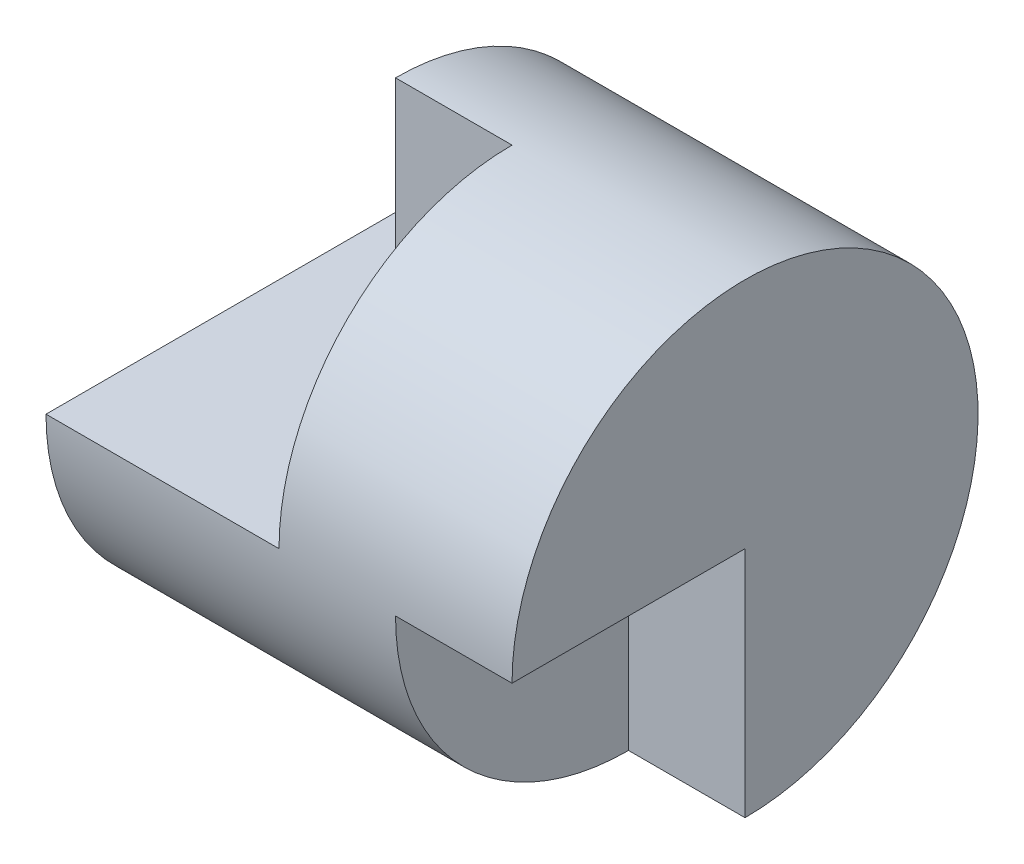
ISO-10303-21;
HEADER;
FILE_DESCRIPTION(('STEP AP214'),'2;1');
FILE_NAME('part.step','',(''),(''),'','','');
FILE_SCHEMA(('AUTOMOTIVE_DESIGN { 1 0 10303 214 1 1 1 1 }'));
ENDSEC;
DATA;
#1=APPLICATION_CONTEXT('core data for automotive mechanical design processes');
#2=APPLICATION_PROTOCOL_DEFINITION('international standard','automotive_design',2000,#1);
#3=PRODUCT_CONTEXT('',#1,'mechanical');
#4=PRODUCT('Part','Part','',(#3));
#5=PRODUCT_RELATED_PRODUCT_CATEGORY('part','',(#4));
#6=PRODUCT_DEFINITION_FORMATION('','',#4);
#7=PRODUCT_DEFINITION_CONTEXT('part definition',#1,'design');
#8=PRODUCT_DEFINITION('design','',#6,#7);
#9=PRODUCT_DEFINITION_SHAPE('','',#8);
#10=(LENGTH_UNIT() NAMED_UNIT(*) SI_UNIT(.MILLI.,.METRE.));
#11=(NAMED_UNIT(*) PLANE_ANGLE_UNIT() SI_UNIT($,.RADIAN.));
#12=(NAMED_UNIT(*) SI_UNIT($,.STERADIAN.) SOLID_ANGLE_UNIT());
#13=UNCERTAINTY_MEASURE_WITH_UNIT(LENGTH_MEASURE(1.E-05),#10,'distance_accuracy_value','');
#14=(GEOMETRIC_REPRESENTATION_CONTEXT(3) GLOBAL_UNCERTAINTY_ASSIGNED_CONTEXT((#13)) GLOBAL_UNIT_ASSIGNED_CONTEXT((#10,
#11,#12)) REPRESENTATION_CONTEXT('',''));
#15=CARTESIAN_POINT('',(0.,0.,0.));
#16=DIRECTION('',(0.,0.,1.));
#17=DIRECTION('',(1.,0.,0.));
#18=AXIS2_PLACEMENT_3D('',#15,#16,#17);
#19=CARTESIAN_POINT('',(0.,0.,0.));
#20=DIRECTION('',(-1.,0.,0.));
#21=DIRECTION('',(0.,0.,1.));
#22=AXIS2_PLACEMENT_3D('',#19,#20,#21);
#23=CYLINDRICAL_SURFACE('',#22,2.);
#24=DIRECTION('',(-1.,0.,0.));
#25=VECTOR('',#24,1.);
#26=CARTESIAN_POINT('',(0.,-2.,0.));
#27=LINE('',#26,#25);
#28=CARTESIAN_POINT('',(3.,-2.,0.));
#29=VERTEX_POINT('',#28);
#30=CARTESIAN_POINT('',(4.,-2.,0.));
#31=VERTEX_POINT('',#30);
#32=EDGE_CURVE('E112',#29,#31,#27,.F.);
#33=ORIENTED_EDGE('',*,*,#32,.F.);
#34=CARTESIAN_POINT('',(3.,0.,0.));
#35=DIRECTION('',(1.,0.,0.));
#36=DIRECTION('',(0.,0.,-1.));
#37=AXIS2_PLACEMENT_3D('',#34,#35,#36);
#38=CIRCLE('',#37,2.);
#39=CARTESIAN_POINT('',(3.,0.,2.));
#40=VERTEX_POINT('',#39);
#41=EDGE_CURVE('E11',#29,#40,#38,.F.);
#42=ORIENTED_EDGE('',*,*,#41,.T.);
#43=DIRECTION('',(-1.,0.,0.));
#44=VECTOR('',#43,1.);
#45=CARTESIAN_POINT('',(0.,0.,2.));
#46=LINE('',#45,#44);
#47=CARTESIAN_POINT('',(4.,0.,2.));
#48=VERTEX_POINT('',#47);
#49=EDGE_CURVE('E104',#48,#40,#46,.T.);
#50=ORIENTED_EDGE('',*,*,#49,.F.);
#51=CARTESIAN_POINT('',(4.,0.,0.));
#52=DIRECTION('',(-1.,0.,0.));
#53=DIRECTION('',(0.,0.,1.));
#54=AXIS2_PLACEMENT_3D('',#51,#52,#53);
#55=CIRCLE('',#54,2.);
#56=EDGE_CURVE('E133',#48,#31,#55,.T.);
#57=ORIENTED_EDGE('',*,*,#56,.T.);
#58=EDGE_LOOP('',(#33,#42,#50,#57));
#59=FACE_BOUND('',#58,.T.);
#60=CARTESIAN_POINT('',(2.,0.,0.));
#61=DIRECTION('',(1.,0.,0.));
#62=DIRECTION('',(0.,0.,-1.));
#63=AXIS2_PLACEMENT_3D('',#60,#61,#62);
#64=CIRCLE('',#63,2.);
#65=CARTESIAN_POINT('',(2.,0.,2.));
#66=VERTEX_POINT('',#65);
#67=CARTESIAN_POINT('',(2.,2.,0.));
#68=VERTEX_POINT('',#67);
#69=EDGE_CURVE('E143',#66,#68,#64,.F.);
#70=ORIENTED_EDGE('',*,*,#69,.F.);
#71=DIRECTION('',(-1.,0.,0.));
#72=VECTOR('',#71,1.);
#73=CARTESIAN_POINT('',(0.,0.,2.));
#74=LINE('',#73,#72);
#75=CARTESIAN_POINT('',(0.,0.,2.));
#76=VERTEX_POINT('',#75);
#77=EDGE_CURVE('E125',#76,#66,#74,.F.);
#78=ORIENTED_EDGE('',*,*,#77,.F.);
#79=CARTESIAN_POINT('',(0.,0.,0.));
#80=DIRECTION('',(-1.,0.,0.));
#81=DIRECTION('',(0.,0.,1.));
#82=AXIS2_PLACEMENT_3D('',#79,#80,#81);
#83=CIRCLE('',#82,2.);
#84=CARTESIAN_POINT('',(0.,0.,-2.));
#85=VERTEX_POINT('',#84);
#86=EDGE_CURVE('E136',#85,#76,#83,.T.);
#87=ORIENTED_EDGE('',*,*,#86,.F.);
#88=DIRECTION('',(-1.,0.,0.));
#89=VECTOR('',#88,1.);
#90=CARTESIAN_POINT('',(0.,0.,-2.));
#91=LINE('',#90,#89);
#92=CARTESIAN_POINT('',(1.,0.,-2.));
#93=VERTEX_POINT('',#92);
#94=EDGE_CURVE('E131',#93,#85,#91,.T.);
#95=ORIENTED_EDGE('',*,*,#94,.F.);
#96=CARTESIAN_POINT('',(1.,0.,0.));
#97=DIRECTION('',(-1.,0.,0.));
#98=DIRECTION('',(0.,-1.,0.));
#99=AXIS2_PLACEMENT_3D('',#96,#97,#98);
#100=CIRCLE('',#99,2.);
#101=CARTESIAN_POINT('',(1.,2.,0.));
#102=VERTEX_POINT('',#101);
#103=EDGE_CURVE('E55',#93,#102,#100,.F.);
#104=ORIENTED_EDGE('',*,*,#103,.T.);
#105=DIRECTION('',(1.,0.,0.));
#106=VECTOR('',#105,1.);
#107=CARTESIAN_POINT('',(0.5,2.,0.));
#108=LINE('',#107,#106);
#109=EDGE_CURVE('E114',#102,#68,#108,.T.);
#110=ORIENTED_EDGE('',*,*,#109,.T.);
#111=EDGE_LOOP('',(#70,#78,#87,#95,#104,#110));
#112=FACE_BOUND('',#111,.T.);
#113=ADVANCED_FACE('F33',(#59,#112),#23,.T.);
#114=CARTESIAN_POINT('',(4.,0.,0.));
#115=DIRECTION('',(-1.,0.,0.));
#116=DIRECTION('',(0.,0.,1.));
#117=AXIS2_PLACEMENT_3D('',#114,#115,#116);
#118=PLANE('',#117);
#119=DIRECTION('',(0.,0.,1.));
#120=VECTOR('',#119,1.);
#121=CARTESIAN_POINT('',(4.,0.,0.));
#122=LINE('',#121,#120);
#123=CARTESIAN_POINT('',(4.,0.,0.));
#124=VERTEX_POINT('',#123);
#125=EDGE_CURVE('E99',#124,#48,#122,.T.);
#126=ORIENTED_EDGE('',*,*,#125,.F.);
#127=DIRECTION('',(0.,-1.,0.));
#128=VECTOR('',#127,1.);
#129=CARTESIAN_POINT('',(4.,0.,0.));
#130=LINE('',#129,#128);
#131=EDGE_CURVE('E40',#124,#31,#130,.T.);
#132=ORIENTED_EDGE('',*,*,#131,.T.);
#133=ORIENTED_EDGE('',*,*,#56,.F.);
#134=EDGE_LOOP('',(#126,#132,#133));
#135=FACE_BOUND('',#134,.T.);
#136=ADVANCED_FACE('F146',(#135),#118,.F.);
#137=CARTESIAN_POINT('',(0.,-2.,0.));
#138=DIRECTION('',(1.,0.,0.));
#139=DIRECTION('',(0.,0.,-1.));
#140=AXIS2_PLACEMENT_3D('',#137,#138,#139);
#141=PLANE('',#140);
#142=ORIENTED_EDGE('',*,*,#86,.T.);
#143=DIRECTION('',(0.,0.,-1.));
#144=VECTOR('',#143,1.);
#145=CARTESIAN_POINT('',(0.,0.,0.));
#146=LINE('',#145,#144);
#147=EDGE_CURVE('E139',#76,#85,#146,.T.);
#148=ORIENTED_EDGE('',*,*,#147,.T.);
#149=EDGE_LOOP('',(#142,#148));
#150=FACE_BOUND('',#149,.T.);
#151=ADVANCED_FACE('F165',(#150),#141,.F.);
#152=CARTESIAN_POINT('',(1.,0.,-11.));
#153=DIRECTION('',(-1.,0.,0.));
#154=DIRECTION('',(0.,-1.,0.));
#155=AXIS2_PLACEMENT_3D('',#152,#153,#154);
#156=PLANE('',#155);
#157=DIRECTION('',(0.,0.,1.));
#158=VECTOR('',#157,1.);
#159=CARTESIAN_POINT('',(1.,0.,-11.));
#160=LINE('',#159,#158);
#161=CARTESIAN_POINT('',(1.,0.,0.));
#162=VERTEX_POINT('',#161);
#163=EDGE_CURVE('E129',#93,#162,#160,.T.);
#164=ORIENTED_EDGE('',*,*,#163,.T.);
#165=DIRECTION('',(0.,-1.,0.));
#166=VECTOR('',#165,1.);
#167=CARTESIAN_POINT('',(1.,0.,0.));
#168=LINE('',#167,#166);
#169=EDGE_CURVE('E127',#102,#162,#168,.T.);
#170=ORIENTED_EDGE('',*,*,#169,.F.);
#171=ORIENTED_EDGE('',*,*,#103,.F.);
#172=EDGE_LOOP('',(#164,#170,#171));
#173=FACE_BOUND('',#172,.T.);
#174=ADVANCED_FACE('F163',(#173),#156,.T.);
#175=CARTESIAN_POINT('',(0.,0.,-11.));
#176=DIRECTION('',(0.,-1.,0.));
#177=DIRECTION('',(1.,0.,0.));
#178=AXIS2_PLACEMENT_3D('',#175,#176,#177);
#179=PLANE('',#178);
#180=DIRECTION('',(-1.,0.,0.));
#181=VECTOR('',#180,1.);
#182=CARTESIAN_POINT('',(0.5,0.,0.));
#183=LINE('',#182,#181);
#184=CARTESIAN_POINT('',(2.,0.,0.));
#185=VERTEX_POINT('',#184);
#186=EDGE_CURVE('E120',#185,#162,#183,.T.);
#187=ORIENTED_EDGE('',*,*,#186,.T.);
#188=ORIENTED_EDGE('',*,*,#163,.F.);
#189=ORIENTED_EDGE('',*,*,#94,.T.);
#190=ORIENTED_EDGE('',*,*,#147,.F.);
#191=ORIENTED_EDGE('',*,*,#77,.T.);
#192=DIRECTION('',(0.,0.,-1.));
#193=VECTOR('',#192,1.);
#194=CARTESIAN_POINT('',(2.,0.,10.));
#195=LINE('',#194,#193);
#196=EDGE_CURVE('E123',#66,#185,#195,.T.);
#197=ORIENTED_EDGE('',*,*,#196,.T.);
#198=EDGE_LOOP('',(#187,#188,#189,#190,#191,#197));
#199=FACE_BOUND('',#198,.T.);
#200=ADVANCED_FACE('F161',(#199),#179,.F.);
#201=CARTESIAN_POINT('',(2.,0.,10.));
#202=DIRECTION('',(1.,0.,0.));
#203=DIRECTION('',(0.,0.,-1.));
#204=AXIS2_PLACEMENT_3D('',#201,#202,#203);
#205=PLANE('',#204);
#206=ORIENTED_EDGE('',*,*,#69,.T.);
#207=DIRECTION('',(0.,-1.,0.));
#208=VECTOR('',#207,1.);
#209=CARTESIAN_POINT('',(2.,0.,0.));
#210=LINE('',#209,#208);
#211=EDGE_CURVE('E117',#68,#185,#210,.T.);
#212=ORIENTED_EDGE('',*,*,#211,.T.);
#213=ORIENTED_EDGE('',*,*,#196,.F.);
#214=EDGE_LOOP('',(#206,#212,#213));
#215=FACE_BOUND('',#214,.T.);
#216=ADVANCED_FACE('F156',(#215),#205,.F.);
#217=CARTESIAN_POINT('',(0.,0.,0.));
#218=DIRECTION('',(0.,0.,-1.));
#219=DIRECTION('',(-1.,0.,0.));
#220=AXIS2_PLACEMENT_3D('',#217,#218,#219);
#221=PLANE('',#220);
#222=ORIENTED_EDGE('',*,*,#169,.T.);
#223=ORIENTED_EDGE('',*,*,#186,.F.);
#224=ORIENTED_EDGE('',*,*,#211,.F.);
#225=ORIENTED_EDGE('',*,*,#109,.F.);
#226=EDGE_LOOP('',(#222,#223,#224,#225));
#227=FACE_BOUND('',#226,.T.);
#228=ADVANCED_FACE('F159',(#227),#221,.F.);
#229=CARTESIAN_POINT('',(3.,-2.32463110102157,0.));
#230=DIRECTION('',(0.,0.,-1.));
#231=DIRECTION('',(-1.,0.,0.));
#232=AXIS2_PLACEMENT_3D('',#229,#230,#231);
#233=PLANE('',#232);
#234=ORIENTED_EDGE('',*,*,#32,.T.);
#235=ORIENTED_EDGE('',*,*,#131,.F.);
#236=DIRECTION('',(1.,0.,0.));
#237=VECTOR('',#236,1.);
#238=CARTESIAN_POINT('',(3.,0.,0.));
#239=LINE('',#238,#237);
#240=CARTESIAN_POINT('',(3.,0.,0.));
#241=VERTEX_POINT('',#240);
#242=EDGE_CURVE('E47',#241,#124,#239,.T.);
#243=ORIENTED_EDGE('',*,*,#242,.F.);
#244=DIRECTION('',(0.,1.,0.));
#245=VECTOR('',#244,1.);
#246=CARTESIAN_POINT('',(3.,-2.32463110102157,0.));
#247=LINE('',#246,#245);
#248=EDGE_CURVE('E94',#29,#241,#247,.T.);
#249=ORIENTED_EDGE('',*,*,#248,.F.);
#250=EDGE_LOOP('',(#234,#235,#243,#249));
#251=FACE_BOUND('',#250,.T.);
#252=ADVANCED_FACE('F101',(#251),#233,.F.);
#253=CARTESIAN_POINT('',(3.,0.,0.));
#254=DIRECTION('',(0.,1.,0.));
#255=DIRECTION('',(0.,0.,1.));
#256=AXIS2_PLACEMENT_3D('',#253,#254,#255);
#257=PLANE('',#256);
#258=ORIENTED_EDGE('',*,*,#49,.T.);
#259=DIRECTION('',(0.,0.,1.));
#260=VECTOR('',#259,1.);
#261=CARTESIAN_POINT('',(3.,0.,0.));
#262=LINE('',#261,#260);
#263=EDGE_CURVE('E96',#241,#40,#262,.T.);
#264=ORIENTED_EDGE('',*,*,#263,.F.);
#265=ORIENTED_EDGE('',*,*,#242,.T.);
#266=ORIENTED_EDGE('',*,*,#125,.T.);
#267=EDGE_LOOP('',(#258,#264,#265,#266));
#268=FACE_BOUND('',#267,.T.);
#269=ADVANCED_FACE('F106',(#268),#257,.F.);
#270=CARTESIAN_POINT('',(3.,0.,0.));
#271=DIRECTION('',(1.,0.,0.));
#272=DIRECTION('',(0.,0.,-1.));
#273=AXIS2_PLACEMENT_3D('',#270,#271,#272);
#274=PLANE('',#273);
#275=ORIENTED_EDGE('',*,*,#248,.T.);
#276=ORIENTED_EDGE('',*,*,#263,.T.);
#277=ORIENTED_EDGE('',*,*,#41,.F.);
#278=EDGE_LOOP('',(#275,#276,#277));
#279=FACE_BOUND('',#278,.T.);
#280=ADVANCED_FACE('F95',(#279),#274,.T.);
#281=CLOSED_SHELL('',(#113,#136,#151,#174,#200,#216,#228,#252,#269,#280));
#282=MANIFOLD_SOLID_BREP('B2',#281);
#283=ADVANCED_BREP_SHAPE_REPRESENTATION('',(#18,#282),#14);
#284=SHAPE_DEFINITION_REPRESENTATION(#9,#283);
ENDSEC;
END-ISO-10303-21;
